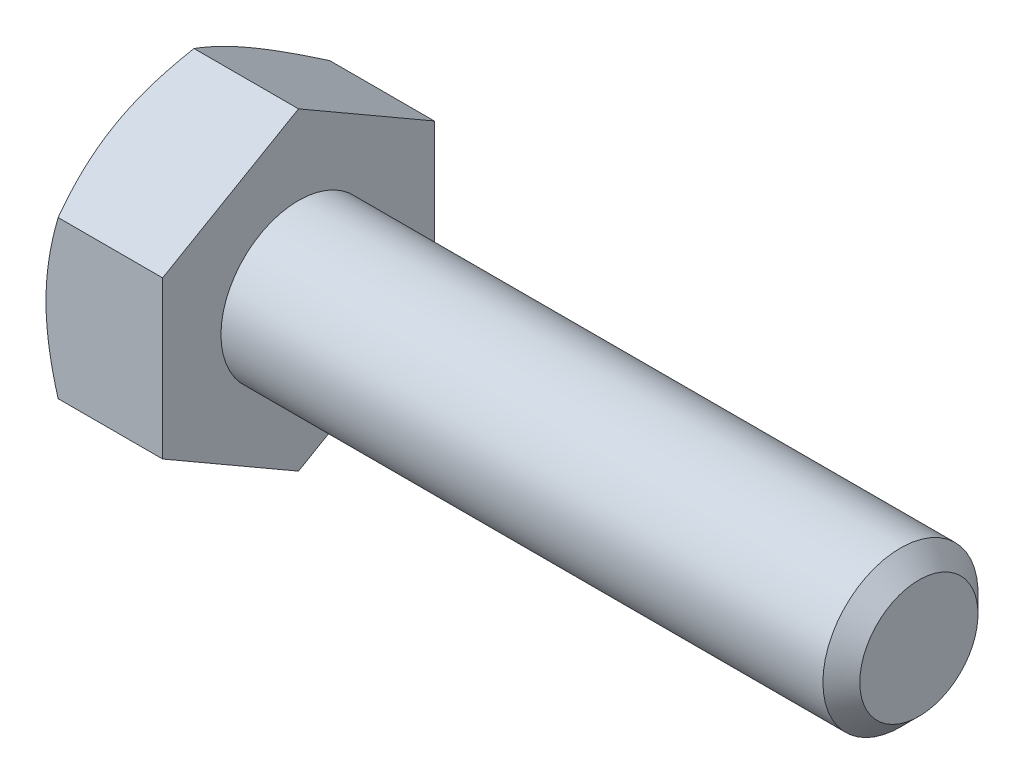
ISO-10303-21;
HEADER;
FILE_DESCRIPTION(('STEP AP214'),'2;1');
FILE_NAME('part.step','',(''),(''),'','','');
FILE_SCHEMA(('AUTOMOTIVE_DESIGN { 1 0 10303 214 1 1 1 1 }'));
ENDSEC;
DATA;
#1=APPLICATION_CONTEXT('core data for automotive mechanical design processes');
#2=APPLICATION_PROTOCOL_DEFINITION('international standard','automotive_design',2000,#1);
#3=PRODUCT_CONTEXT('',#1,'mechanical');
#4=PRODUCT('Part','Part','',(#3));
#5=PRODUCT_RELATED_PRODUCT_CATEGORY('part','',(#4));
#6=PRODUCT_DEFINITION_FORMATION('','',#4);
#7=PRODUCT_DEFINITION_CONTEXT('part definition',#1,'design');
#8=PRODUCT_DEFINITION('design','',#6,#7);
#9=PRODUCT_DEFINITION_SHAPE('','',#8);
#10=(LENGTH_UNIT() NAMED_UNIT(*) SI_UNIT(.MILLI.,.METRE.));
#11=(NAMED_UNIT(*) PLANE_ANGLE_UNIT() SI_UNIT($,.RADIAN.));
#12=(NAMED_UNIT(*) SI_UNIT($,.STERADIAN.) SOLID_ANGLE_UNIT());
#13=UNCERTAINTY_MEASURE_WITH_UNIT(LENGTH_MEASURE(1.E-05),#10,'distance_accuracy_value','');
#14=(GEOMETRIC_REPRESENTATION_CONTEXT(3) GLOBAL_UNCERTAINTY_ASSIGNED_CONTEXT((#13)) GLOBAL_UNIT_ASSIGNED_CONTEXT((#10,
#11,#12)) REPRESENTATION_CONTEXT('',''));
#15=CARTESIAN_POINT('',(0.,0.,0.));
#16=DIRECTION('',(0.,0.,1.));
#17=DIRECTION('',(1.,0.,0.));
#18=AXIS2_PLACEMENT_3D('',#15,#16,#17);
#19=CARTESIAN_POINT('',(4.7752,3.21156860739421,-5.5626));
#20=DIRECTION('',(0.,-0.866025403784438,0.500000000000001));
#21=DIRECTION('',(0.,-0.500000000000001,-0.866025403784438));
#22=AXIS2_PLACEMENT_3D('',#19,#20,#21);
#23=PLANE('',#22);
#24=CARTESIAN_POINT('',(0.496898061070139,6.42325268484227,0.0002));
#25=CARTESIAN_POINT('',(0.456146202255127,6.35265858120791,-0.122072574209491));
#26=CARTESIAN_POINT('',(0.41724377530872,6.2818012683745,-0.244801040124762));
#27=CARTESIAN_POINT('',(0.34364716156054,6.13951120287093,-0.491254662989243));
#28=CARTESIAN_POINT('',(0.308954790139042,6.06807821602766,-0.614980225538197));
#29=CARTESIAN_POINT('',(0.211873701066853,5.8526355064814,-0.98813794459262));
#30=CARTESIAN_POINT('',(0.156654841923372,5.70777535201369,-1.23904309212296));
#31=CARTESIAN_POINT('',(0.0919037861815274,5.49099476252076,-1.61451808721945));
#32=CARTESIAN_POINT('',(0.0734579983429336,5.419722058732,-1.73796603137439));
#33=CARTESIAN_POINT('',(0.0425268916674617,5.27685459691414,-1.98541973399132));
#34=CARTESIAN_POINT('',(0.0300410461890079,5.20525986790489,-2.10942544218948));
#35=CARTESIAN_POINT('',(0.0113480299394706,5.06194605565758,-2.35765224642821));
#36=CARTESIAN_POINT('',(0.00513373340584711,4.9902272065059,-2.48187293701927));
#37=CARTESIAN_POINT('',(-0.000889599359095119,4.84672720555796,-2.7304222295473));
#38=CARTESIAN_POINT('',(-0.000698833448295683,4.7749460557547,-2.85475082803225));
#39=CARTESIAN_POINT('',(0.00862810136342349,4.57828637012706,-3.19537539533984));
#40=CARTESIAN_POINT('',(0.0242873955350759,4.4534722013835,-3.41155987710816));
#41=CARTESIAN_POINT('',(0.0739443233816047,4.20467287416474,-3.84249295274001));
#42=CARTESIAN_POINT('',(0.107958931423457,4.08068859075412,-4.05724003094723));
#43=CARTESIAN_POINT('',(0.192986041409675,3.83138850679899,-4.4890404426887));
#44=CARTESIAN_POINT('',(0.244358813937399,3.70610416511176,-4.70603928788379));
#45=CARTESIAN_POINT('',(0.36095445699959,3.45740388365365,-5.13680081122592));
#46=CARTESIAN_POINT('',(0.426149937617055,3.33398475856357,-5.35056900650764));
#47=CARTESIAN_POINT('',(0.496898061070134,3.21145313734037,-5.5628));
#48=B_SPLINE_CURVE_WITH_KNOTS('',3,(#24,#25,#26,#27,#28,#29,#30,#31,#32,#33,#34,#35,#36,#37,#38,
#39,#40,#41,#42,#43,#44,#45,#46,#47),.UNSPECIFIED.,.F.,.F.,(4,2,2,2,2,2,2,2,2,2,2,4),(0.,
0.44082011856227,0.881829648847399,1.76568130465016,2.19678242164486,2.62784543796583,
3.05841812523867,3.48897751176352,4.23854798324166,4.98881282275669,5.75571809391027,
6.52111769989992),.UNSPECIFIED.);
#49=CARTESIAN_POINT('',(0.496831392605784,6.42313721478843,0.));
#50=VERTEX_POINT('',#49);
#51=CARTESIAN_POINT('',(0.,4.81735291109131,-2.78130000000001));
#52=VERTEX_POINT('',#51);
#53=EDGE_CURVE('E53',#50,#52,#48,.T.);
#54=ORIENTED_EDGE('',*,*,#53,.F.);
#55=DIRECTION('',(-1.,0.,0.));
#56=VECTOR('',#55,1.);
#57=CARTESIAN_POINT('',(4.7752,6.42313721478843,0.));
#58=LINE('',#57,#56);
#59=CARTESIAN_POINT('',(4.7752,6.42313721478843,0.));
#60=VERTEX_POINT('',#59);
#61=EDGE_CURVE('E149',#60,#50,#58,.T.);
#62=ORIENTED_EDGE('',*,*,#61,.F.);
#63=DIRECTION('',(0.,0.500000000000001,0.866025403784438));
#64=VECTOR('',#63,1.);
#65=CARTESIAN_POINT('',(4.7752,3.21156860739421,-5.5626));
#66=LINE('',#65,#64);
#67=CARTESIAN_POINT('',(4.7752,3.21156860739421,-5.5626));
#68=VERTEX_POINT('',#67);
#69=EDGE_CURVE('E234',#68,#60,#66,.T.);
#70=ORIENTED_EDGE('',*,*,#69,.F.);
#71=DIRECTION('',(-1.,0.,0.));
#72=VECTOR('',#71,1.);
#73=CARTESIAN_POINT('',(4.7752,3.21156860739421,-5.5626));
#74=LINE('',#73,#72);
#75=CARTESIAN_POINT('',(0.496831392605779,3.21156860739421,-5.5626));
#76=VERTEX_POINT('',#75);
#77=EDGE_CURVE('E137',#68,#76,#74,.T.);
#78=ORIENTED_EDGE('',*,*,#77,.T.);
#79=EDGE_CURVE('E131',#52,#76,#48,.T.);
#80=ORIENTED_EDGE('',*,*,#79,.F.);
#81=EDGE_LOOP('',(#54,#62,#70,#78,#80));
#82=FACE_BOUND('',#81,.T.);
#83=ADVANCED_FACE('F37',(#82),#23,.F.);
#84=CARTESIAN_POINT('',(4.7752,6.42313721478843,0.));
#85=DIRECTION('',(0.,-0.866025403784438,-0.500000000000001));
#86=DIRECTION('',(0.,0.500000000000001,-0.866025403784438));
#87=AXIS2_PLACEMENT_3D('',#84,#85,#86);
#88=PLANE('',#87);
#89=CARTESIAN_POINT('',(0.496898061070134,3.21145313734037,5.5628));
#90=CARTESIAN_POINT('',(0.456146202255121,3.28204724097473,5.44052742579051));
#91=CARTESIAN_POINT('',(0.417243775308715,3.35290455380814,5.31779895987524));
#92=CARTESIAN_POINT('',(0.343647161560535,3.49519461931171,5.07134533701076));
#93=CARTESIAN_POINT('',(0.308954790139038,3.56662760615499,4.9476197744618));
#94=CARTESIAN_POINT('',(0.21187370106685,3.78207031570124,4.57446205540738));
#95=CARTESIAN_POINT('',(0.15665484192337,3.92693047016895,4.32355690787704));
#96=CARTESIAN_POINT('',(0.0919037861815261,4.14371105966188,3.94808191278055));
#97=CARTESIAN_POINT('',(0.0734579983429322,4.21498376345064,3.82463396862561));
#98=CARTESIAN_POINT('',(0.0425268916674608,4.35785122526849,3.57718026600868));
#99=CARTESIAN_POINT('',(0.0300410461890074,4.42944595427775,3.45317455781052));
#100=CARTESIAN_POINT('',(0.0113480299394703,4.57275976652506,3.20494775357179));
#101=CARTESIAN_POINT('',(0.00513373340584643,4.64447861567674,3.08072706298073));
#102=CARTESIAN_POINT('',(-0.000889599359095678,4.78797861662468,2.8321777704527));
#103=CARTESIAN_POINT('',(-0.000698833448295769,4.85975976642794,2.70784917196775));
#104=CARTESIAN_POINT('',(0.00862810136342435,5.05641945205558,2.36722460466016));
#105=CARTESIAN_POINT('',(0.0242873955350771,5.18123362079914,2.15104012289184));
#106=CARTESIAN_POINT('',(0.0739443233816067,5.4300329480179,1.72010704725999));
#107=CARTESIAN_POINT('',(0.107958931423459,5.55401723142852,1.50535996905278));
#108=CARTESIAN_POINT('',(0.192986041409678,5.80331731538365,1.0735595573113));
#109=CARTESIAN_POINT('',(0.244358813937402,5.92860165707088,0.856560712116214));
#110=CARTESIAN_POINT('',(0.360954456999594,6.17730193852899,0.425799188774084));
#111=CARTESIAN_POINT('',(0.426149937617059,6.30072106361907,0.212030993492364));
#112=CARTESIAN_POINT('',(0.496898061070139,6.42325268484227,-0.000200000000000177));
#113=B_SPLINE_CURVE_WITH_KNOTS('',3,(#89,#90,#91,#92,#93,#94,#95,#96,#97,#98,#99,#100,#101,#102,
#103,#104,#105,#106,#107,#108,#109,#110,#111,#112),.UNSPECIFIED.,.F.,.F.,(4,2,2,2,2,2,2,2,2,2,2,
4),(0.,0.44082011856227,0.881829648847398,1.76568130465016,2.19678242164486,2.62784543796582,
3.05841812523867,3.48897751176352,4.23854798324165,4.98881282275669,5.75571809391027,
6.52111769989992),.UNSPECIFIED.);
#114=CARTESIAN_POINT('',(0.496831392605779,3.21156860739421,5.5626));
#115=VERTEX_POINT('',#114);
#116=CARTESIAN_POINT('',(0.,4.81735291109132,2.78130000000001));
#117=VERTEX_POINT('',#116);
#118=EDGE_CURVE('E60',#115,#117,#113,.T.);
#119=ORIENTED_EDGE('',*,*,#118,.F.);
#120=DIRECTION('',(-1.,0.,0.));
#121=VECTOR('',#120,1.);
#122=CARTESIAN_POINT('',(4.7752,3.21156860739421,5.5626));
#123=LINE('',#122,#121);
#124=CARTESIAN_POINT('',(4.7752,3.21156860739421,5.5626));
#125=VERTEX_POINT('',#124);
#126=EDGE_CURVE('E147',#125,#115,#123,.T.);
#127=ORIENTED_EDGE('',*,*,#126,.F.);
#128=DIRECTION('',(0.,-0.500000000000001,0.866025403784438));
#129=VECTOR('',#128,1.);
#130=CARTESIAN_POINT('',(4.7752,6.42313721478843,0.));
#131=LINE('',#130,#129);
#132=EDGE_CURVE('E232',#60,#125,#131,.T.);
#133=ORIENTED_EDGE('',*,*,#132,.F.);
#134=ORIENTED_EDGE('',*,*,#61,.T.);
#135=EDGE_CURVE('E164',#117,#50,#113,.T.);
#136=ORIENTED_EDGE('',*,*,#135,.F.);
#137=EDGE_LOOP('',(#119,#127,#133,#134,#136));
#138=FACE_BOUND('',#137,.T.);
#139=ADVANCED_FACE('F170',(#138),#88,.F.);
#140=CARTESIAN_POINT('',(4.7752,3.21156860739421,5.5626));
#141=DIRECTION('',(0.,0.,-1.));
#142=DIRECTION('',(0.,1.,0.));
#143=AXIS2_PLACEMENT_3D('',#140,#141,#142);
#144=PLANE('',#143);
#145=CARTESIAN_POINT('',(2.76946298300575,-8.73931907508179,5.5626));
#146=CARTESIAN_POINT('',(2.65067477861525,-8.49536496655184,5.5626));
#147=CARTESIAN_POINT('',(2.5329935446368,-8.25086273482906,5.5626));
#148=CARTESIAN_POINT('',(2.30046552472365,-7.7604709003827,5.5626));
#149=CARTESIAN_POINT('',(2.1856191646097,-7.51458109596806,5.5626));
#150=CARTESIAN_POINT('',(1.95882765731768,-7.0199096787591,5.5626));
#151=CARTESIAN_POINT('',(1.84690075513497,-6.77111967311545,5.5626));
#152=CARTESIAN_POINT('',(1.62748022476039,-6.27159952967085,5.5626));
#153=CARTESIAN_POINT('',(1.51998639425645,-6.02086948102922,5.5626));
#154=CARTESIAN_POINT('',(1.30708686388972,-5.50862062722721,5.5626));
#155=CARTESIAN_POINT('',(1.20187213532633,-5.24702202923403,5.5626));
#156=CARTESIAN_POINT('',(0.999136459179903,-4.72080610855176,5.5626));
#157=CARTESIAN_POINT('',(0.901616358819175,-4.45618845710901,5.5626));
#158=CARTESIAN_POINT('',(0.716747077259975,-3.92397402708935,5.5626));
#159=CARTESIAN_POINT('',(0.629378259967488,-3.65638413524642,5.5626));
#160=CARTESIAN_POINT('',(0.467540995587156,-3.11736467473257,5.5626));
#161=CARTESIAN_POINT('',(0.393068604009399,-2.84593630766607,5.5626));
#162=CARTESIAN_POINT('',(0.260913640631054,-2.30059524064208,5.5626));
#163=CARTESIAN_POINT('',(0.203137923936709,-2.02670547200284,5.5626));
#164=CARTESIAN_POINT('',(0.107584140927258,-1.47536640564423,5.5626));
#165=CARTESIAN_POINT('',(0.069803929738993,-1.19791749297778,5.5626));
#166=CARTESIAN_POINT('',(0.0306329032322196,-0.782024036094212,5.5626));
#167=CARTESIAN_POINT('',(0.020503324362524,-0.644369602420744,5.5626));
#168=CARTESIAN_POINT('',(0.00607539244269749,-0.368760083391722,5.5626));
#169=CARTESIAN_POINT('',(0.00177648777087112,-0.230805027714104,5.5626));
#170=CARTESIAN_POINT('',(-0.000882415982739104,0.0451740127451355,5.5626));
#171=CARTESIAN_POINT('',(0.000758104232646407,0.183198002498893,5.5626));
#172=CARTESIAN_POINT('',(0.00993570132662422,0.459040079963629,5.5626));
#173=CARTESIAN_POINT('',(0.0174725518603889,0.596858175374894,5.5626));
#174=CARTESIAN_POINT('',(0.0422505229084574,0.924672768817545,5.5626));
#175=CARTESIAN_POINT('',(0.0620998983879059,1.11447655248114,5.5626));
#176=CARTESIAN_POINT('',(0.111925243816852,1.49274006022235,5.5626));
#177=CARTESIAN_POINT('',(0.141902493413722,1.68119961138343,5.5626));
#178=CARTESIAN_POINT('',(0.245441795133941,2.2443046927153,5.5626));
#179=CARTESIAN_POINT('',(0.332595182135708,2.61648784181077,5.5626));
#180=CARTESIAN_POINT('',(0.484580657527378,3.1732742336233,5.5626));
#181=CARTESIAN_POINT('',(0.539535148349873,3.36074034143572,5.5626));
#182=CARTESIAN_POINT('',(0.655361857948689,3.73385345534555,5.5626));
#183=CARTESIAN_POINT('',(0.71623412173346,3.9195004475956,5.5626));
#184=CARTESIAN_POINT('',(0.842902269493749,4.28903174270247,5.5626));
#185=CARTESIAN_POINT('',(0.908696734383913,4.47291653649103,5.5626));
#186=CARTESIAN_POINT('',(1.04441413366769,4.83914665056045,5.5626));
#187=CARTESIAN_POINT('',(1.11433697738279,5.02149200455412,5.5626));
#188=CARTESIAN_POINT('',(1.3061625425825,5.50788800286086,5.5626));
#189=CARTESIAN_POINT('',(1.43118964362203,5.81070522079336,5.5626));
#190=CARTESIAN_POINT('',(1.68847909941209,6.41326146735261,5.5626));
#191=CARTESIAN_POINT('',(1.82074222486502,6.71300016403485,5.5626));
#192=CARTESIAN_POINT('',(2.09080854484645,7.31009693194887,5.5626));
#193=CARTESIAN_POINT('',(2.2286137757305,7.60745407909744,5.5626));
#194=CARTESIAN_POINT('',(2.50845292691855,8.20015103360304,5.5626));
#195=CARTESIAN_POINT('',(2.65048668230203,8.49549091908621,5.5626));
#196=CARTESIAN_POINT('',(2.93809441213761,9.08501121353834,5.5626));
#197=CARTESIAN_POINT('',(3.08367358186692,9.37918908275016,5.5626));
#198=CARTESIAN_POINT('',(3.37748078904248,9.96621951864088,5.5626));
#199=CARTESIAN_POINT('',(3.52570884757213,10.2590720747479,5.5626));
#200=CARTESIAN_POINT('',(3.97349977904315,11.1358830052649,5.5626));
#201=CARTESIAN_POINT('',(4.2762321417869,11.7182219945537,5.5626));
#202=CARTESIAN_POINT('',(4.85550678228878,12.8193647810355,5.5626));
#203=CARTESIAN_POINT('',(5.13148986853599,13.3384641758493,5.5626));
#204=CARTESIAN_POINT('',(5.68680572895229,14.3749069872876,5.5626));
#205=CARTESIAN_POINT('',(5.96613870161303,14.8922502975048,5.5626));
#206=CARTESIAN_POINT('',(6.52636532741204,15.9238879385591,5.5626));
#207=CARTESIAN_POINT('',(6.80725083144903,16.4381867017066,5.5626));
#208=CARTESIAN_POINT('',(7.37092859266389,17.4656872191565,5.5626));
#209=CARTESIAN_POINT('',(7.65372070150562,17.9788890548016,5.5626));
#210=CARTESIAN_POINT('',(7.93720779623418,18.4917042787924,5.5626));
#211=B_SPLINE_CURVE_WITH_KNOTS('',3,(#145,#146,#147,#148,#149,#150,#151,#152,#153,#154,#155,
#156,#157,#158,#159,#160,#161,#162,#163,#164,#165,#166,#167,#168,#169,#170,#171,#172,#173,#174,
#175,#176,#177,#178,#179,#180,#181,#182,#183,#184,#185,#186,#187,#188,#189,#190,#191,#192,#193,
#194,#195,#196,#197,#198,#199,#200,#201,#202,#203,#204,#205,#206,#207,#208,#209,#210),
.UNSPECIFIED.,.F.,.F.,(4,2,2,2,2,2,2,2,2,2,2,2,2,2,2,2,2,2,2,2,2,2,2,2,2,2,2,2,2,2,2,2,4),(0.,
0.814023059896038,1.62816765754195,2.44655638702215,3.26490772627512,4.11070764230637,
4.95660055613667,5.80082897545883,6.64479872196118,7.48396511886281,8.32304148200847,
8.73701668482868,9.15095272002816,9.5649249474527,9.97888128433685,10.5510771721585,
11.1233453834466,12.2684477479276,12.854460366026,13.4404774414739,14.0263262127402,
14.6121621208114,15.5948602808078,16.5776633116356,17.5608308169621,18.5439600269871,
19.5286286939574,20.5133052017346,22.4822323672198,24.245931208995,26.0097350771296,
27.7677407362569,29.5256111634693),.UNSPECIFIED.);
#212=CARTESIAN_POINT('',(0.496831392605775,-3.21156860739419,5.5626));
#213=VERTEX_POINT('',#212);
#214=CARTESIAN_POINT('',(0.,0.,5.5626));
#215=VERTEX_POINT('',#214);
#216=EDGE_CURVE('E244',#213,#215,#211,.T.);
#217=ORIENTED_EDGE('',*,*,#216,.F.);
#218=DIRECTION('',(-1.,0.,0.));
#219=VECTOR('',#218,1.);
#220=CARTESIAN_POINT('',(4.7752,-3.21156860739419,5.5626));
#221=LINE('',#220,#219);
#222=CARTESIAN_POINT('',(4.7752,-3.21156860739419,5.5626));
#223=VERTEX_POINT('',#222);
#224=EDGE_CURVE('E139',#223,#213,#221,.T.);
#225=ORIENTED_EDGE('',*,*,#224,.F.);
#226=DIRECTION('',(0.,-1.,0.));
#227=VECTOR('',#226,1.);
#228=CARTESIAN_POINT('',(4.7752,3.21156860739421,5.5626));
#229=LINE('',#228,#227);
#230=EDGE_CURVE('E228',#125,#223,#229,.T.);
#231=ORIENTED_EDGE('',*,*,#230,.F.);
#232=ORIENTED_EDGE('',*,*,#126,.T.);
#233=EDGE_CURVE('E186',#215,#115,#211,.T.);
#234=ORIENTED_EDGE('',*,*,#233,.F.);
#235=EDGE_LOOP('',(#217,#225,#231,#232,#234));
#236=FACE_BOUND('',#235,.T.);
#237=ADVANCED_FACE('F250',(#236),#144,.F.);
#238=CARTESIAN_POINT('',(4.7752,-6.42313721478842,0.));
#239=DIRECTION('',(0.,0.866025403784438,-0.500000000000002));
#240=DIRECTION('',(0.,0.500000000000002,0.866025403784438));
#241=AXIS2_PLACEMENT_3D('',#238,#239,#240);
#242=PLANE('',#241);
#243=CARTESIAN_POINT('',(0.496898061070134,-6.42325268484226,-0.000200000000000053));
#244=CARTESIAN_POINT('',(0.456146202255122,-6.3526585812079,0.12207257420949));
#245=CARTESIAN_POINT('',(0.417243775308715,-6.28180126837449,0.244801040124762));
#246=CARTESIAN_POINT('',(0.343647161560535,-6.13951120287092,0.491254662989242));
#247=CARTESIAN_POINT('',(0.308954790139037,-6.06807821602765,0.614980225538196));
#248=CARTESIAN_POINT('',(0.211873701066847,-5.85263550648139,0.988137944592617));
#249=CARTESIAN_POINT('',(0.156654841923367,-5.70777535201368,1.23904309212296));
#250=CARTESIAN_POINT('',(0.0919037861815225,-5.49099476252075,1.61451808721945));
#251=CARTESIAN_POINT('',(0.0734579983429283,-5.41972205873199,1.73796603137439));
#252=CARTESIAN_POINT('',(0.0425268916674564,-5.27685459691413,1.98541973399132));
#253=CARTESIAN_POINT('',(0.0300410461890029,-5.20525986790488,2.10942544218947));
#254=CARTESIAN_POINT('',(0.0113480299394653,-5.06194605565756,2.3576522464282));
#255=CARTESIAN_POINT('',(0.00513373340584106,-4.99022720650589,2.48187293701927));
#256=CARTESIAN_POINT('',(-0.000889599359101576,-4.84672720555795,2.73042222954729));
#257=CARTESIAN_POINT('',(-0.000698833448301867,-4.77494605575469,2.85475082803224));
#258=CARTESIAN_POINT('',(0.00862810136341747,-4.57828637012705,3.19537539533984));
#259=CARTESIAN_POINT('',(0.0242873955350695,-4.45347220138349,3.41155987710815));
#260=CARTESIAN_POINT('',(0.073944323381598,-4.20467287416473,3.84249295274001));
#261=CARTESIAN_POINT('',(0.107958931423451,-4.08068859075411,4.05724003094722));
#262=CARTESIAN_POINT('',(0.192986041409669,-3.83138850679897,4.48904044268869));
#263=CARTESIAN_POINT('',(0.244358813937393,-3.70610416511175,4.70603928788378));
#264=CARTESIAN_POINT('',(0.360954456999585,-3.45740388365364,5.13680081122591));
#265=CARTESIAN_POINT('',(0.42614993761705,-3.33398475856355,5.35056900650763));
#266=CARTESIAN_POINT('',(0.496898061070129,-3.21145313734035,5.5628));
#267=B_SPLINE_CURVE_WITH_KNOTS('',3,(#243,#244,#245,#246,#247,#248,#249,#250,#251,#252,#253,
#254,#255,#256,#257,#258,#259,#260,#261,#262,#263,#264,#265,#266),.UNSPECIFIED.,.F.,.F.,(4,2,2,
2,2,2,2,2,2,2,2,4),(0.,0.440820118562269,0.881829648847397,1.76568130465016,2.19678242164486,
2.62784543796582,3.05841812523867,3.48897751176352,4.23854798324165,4.98881282275669,
5.75571809391027,6.52111769989993),.UNSPECIFIED.);
#268=CARTESIAN_POINT('',(0.496831392605779,-6.42313721478842,0.));
#269=VERTEX_POINT('',#268);
#270=CARTESIAN_POINT('',(0.,-4.81735291109131,2.78130000000001));
#271=VERTEX_POINT('',#270);
#272=EDGE_CURVE('E172',#269,#271,#267,.T.);
#273=ORIENTED_EDGE('',*,*,#272,.F.);
#274=DIRECTION('',(-1.,0.,0.));
#275=VECTOR('',#274,1.);
#276=CARTESIAN_POINT('',(4.7752,-6.42313721478842,0.));
#277=LINE('',#276,#275);
#278=CARTESIAN_POINT('',(4.7752,-6.42313721478842,0.));
#279=VERTEX_POINT('',#278);
#280=EDGE_CURVE('E136',#279,#269,#277,.T.);
#281=ORIENTED_EDGE('',*,*,#280,.F.);
#282=DIRECTION('',(0.,-0.500000000000002,-0.866025403784438));
#283=VECTOR('',#282,1.);
#284=CARTESIAN_POINT('',(4.7752,-6.42313721478842,0.));
#285=LINE('',#284,#283);
#286=EDGE_CURVE('E226',#223,#279,#285,.T.);
#287=ORIENTED_EDGE('',*,*,#286,.F.);
#288=ORIENTED_EDGE('',*,*,#224,.T.);
#289=EDGE_CURVE('E174',#271,#213,#267,.T.);
#290=ORIENTED_EDGE('',*,*,#289,.F.);
#291=EDGE_LOOP('',(#273,#281,#287,#288,#290));
#292=FACE_BOUND('',#291,.T.);
#293=ADVANCED_FACE('F222',(#292),#242,.F.);
#294=CARTESIAN_POINT('',(4.7752,-3.21156860739422,-5.5626));
#295=DIRECTION('',(0.,0.866025403784439,0.499999999999999));
#296=DIRECTION('',(0.,-0.499999999999999,0.866025403784439));
#297=AXIS2_PLACEMENT_3D('',#294,#295,#296);
#298=PLANE('',#297);
#299=CARTESIAN_POINT('',(0.496898061070136,-3.21145313734038,-5.5628));
#300=CARTESIAN_POINT('',(0.456146202255125,-3.28204724097474,-5.44052742579051));
#301=CARTESIAN_POINT('',(0.417243775308717,-3.35290455380815,-5.31779895987524));
#302=CARTESIAN_POINT('',(0.343647161560538,-3.49519461931171,-5.07134533701076));
#303=CARTESIAN_POINT('',(0.308954790139039,-3.56662760615499,-4.9476197744618));
#304=CARTESIAN_POINT('',(0.211873701066851,-3.78207031570125,-4.57446205540738));
#305=CARTESIAN_POINT('',(0.156654841923371,-3.92693047016895,-4.32355690787704));
#306=CARTESIAN_POINT('',(0.0919037861815264,-4.14371105966189,-3.94808191278055));
#307=CARTESIAN_POINT('',(0.0734579983429325,-4.21498376345065,-3.8246339686256));
#308=CARTESIAN_POINT('',(0.0425268916674607,-4.3578512252685,-3.57718026600868));
#309=CARTESIAN_POINT('',(0.0300410461890071,-4.42944595427775,-3.45317455781052));
#310=CARTESIAN_POINT('',(0.0113480299394701,-4.57275976652507,-3.20494775357179));
#311=CARTESIAN_POINT('',(0.00513373340584674,-4.64447861567674,-3.08072706298073));
#312=CARTESIAN_POINT('',(-0.000889599359095496,-4.78797861662468,-2.8321777704527));
#313=CARTESIAN_POINT('',(-0.000698833448296184,-4.85975976642794,-2.70784917196775));
#314=CARTESIAN_POINT('',(0.00862810136342299,-5.05641945205558,-2.36722460466016));
#315=CARTESIAN_POINT('',(0.0242873955350758,-5.18123362079913,-2.15104012289184));
#316=CARTESIAN_POINT('',(0.0739443233816048,-5.4300329480179,-1.72010704725999));
#317=CARTESIAN_POINT('',(0.107958931423457,-5.55401723142852,-1.50535996905277));
#318=CARTESIAN_POINT('',(0.192986041409675,-5.80331731538365,-1.0735595573113));
#319=CARTESIAN_POINT('',(0.244358813937399,-5.92860165707087,-0.856560712116213));
#320=CARTESIAN_POINT('',(0.36095445699959,-6.17730193852898,-0.425799188774084));
#321=CARTESIAN_POINT('',(0.426149937617055,-6.30072106361906,-0.212030993492364));
#322=CARTESIAN_POINT('',(0.496898061070133,-6.42325268484226,0.000200000000000243));
#323=B_SPLINE_CURVE_WITH_KNOTS('',3,(#299,#300,#301,#302,#303,#304,#305,#306,#307,#308,#309,
#310,#311,#312,#313,#314,#315,#316,#317,#318,#319,#320,#321,#322),.UNSPECIFIED.,.F.,.F.,(4,2,2,
2,2,2,2,2,2,2,2,4),(0.,0.44082011856227,0.881829648847399,1.76568130465016,2.19678242164486,
2.62784543796582,3.05841812523867,3.48897751176352,4.23854798324165,4.98881282275669,
5.75571809391027,6.52111769989991),.UNSPECIFIED.);
#324=CARTESIAN_POINT('',(0.496831392605573,-3.21156860739453,-5.5626));
#325=VERTEX_POINT('',#324);
#326=CARTESIAN_POINT('',(0.,-4.81735291109132,-2.7813));
#327=VERTEX_POINT('',#326);
#328=EDGE_CURVE('E113',#325,#327,#323,.T.);
#329=ORIENTED_EDGE('',*,*,#328,.F.);
#330=DIRECTION('',(-1.,0.,0.));
#331=VECTOR('',#330,1.);
#332=CARTESIAN_POINT('',(4.7752,-3.21156860739422,-5.5626));
#333=LINE('',#332,#331);
#334=CARTESIAN_POINT('',(4.7752,-3.21156860739422,-5.5626));
#335=VERTEX_POINT('',#334);
#336=EDGE_CURVE('E127',#335,#325,#333,.T.);
#337=ORIENTED_EDGE('',*,*,#336,.F.);
#338=DIRECTION('',(0.,0.499999999999999,-0.866025403784439));
#339=VECTOR('',#338,1.);
#340=CARTESIAN_POINT('',(4.7752,-3.21156860739422,-5.5626));
#341=LINE('',#340,#339);
#342=EDGE_CURVE('E224',#279,#335,#341,.T.);
#343=ORIENTED_EDGE('',*,*,#342,.F.);
#344=ORIENTED_EDGE('',*,*,#280,.T.);
#345=EDGE_CURVE('E130',#327,#269,#323,.T.);
#346=ORIENTED_EDGE('',*,*,#345,.F.);
#347=EDGE_LOOP('',(#329,#337,#343,#344,#346));
#348=FACE_BOUND('',#347,.T.);
#349=ADVANCED_FACE('F125',(#348),#298,.F.);
#350=CARTESIAN_POINT('',(4.7752,3.21156860739421,-5.5626));
#351=DIRECTION('',(0.,0.,1.));
#352=DIRECTION('',(0.,-1.,0.));
#353=AXIS2_PLACEMENT_3D('',#350,#351,#352);
#354=PLANE('',#353);
#355=CARTESIAN_POINT('',(2.76946298300577,-8.73931907508182,-5.5626));
#356=CARTESIAN_POINT('',(2.65067477861526,-8.49536496655187,-5.5626));
#357=CARTESIAN_POINT('',(2.53299354463681,-8.25086273482909,-5.5626));
#358=CARTESIAN_POINT('',(2.30046552472366,-7.76047090038272,-5.5626));
#359=CARTESIAN_POINT('',(2.18561916460971,-7.51458109596809,-5.5626));
#360=CARTESIAN_POINT('',(1.95882765731769,-7.01990967875913,-5.5626));
#361=CARTESIAN_POINT('',(1.84690075513498,-6.77111967311548,-5.5626));
#362=CARTESIAN_POINT('',(1.6274802247604,-6.27159952967088,-5.5626));
#363=CARTESIAN_POINT('',(1.51998639425646,-6.02086948102925,-5.5626));
#364=CARTESIAN_POINT('',(1.30708686388974,-5.50862062722724,-5.5626));
#365=CARTESIAN_POINT('',(1.20187213532634,-5.24702202923405,-5.5626));
#366=CARTESIAN_POINT('',(0.999136459179912,-4.72080610855178,-5.5626));
#367=CARTESIAN_POINT('',(0.901616358819183,-4.45618845710904,-5.5626));
#368=CARTESIAN_POINT('',(0.716747077259982,-3.92397402708937,-5.5626));
#369=CARTESIAN_POINT('',(0.629378259967495,-3.65638413524644,-5.5626));
#370=CARTESIAN_POINT('',(0.467540995587163,-3.11736467473259,-5.5626));
#371=CARTESIAN_POINT('',(0.393068604009405,-2.84593630766609,-5.5626));
#372=CARTESIAN_POINT('',(0.260913640631059,-2.3005952406421,-5.5626));
#373=CARTESIAN_POINT('',(0.203137923936713,-2.02670547200285,-5.5626));
#374=CARTESIAN_POINT('',(0.10758414092726,-1.47536640564425,-5.5626));
#375=CARTESIAN_POINT('',(0.0698039297389953,-1.19791749297779,-5.5626));
#376=CARTESIAN_POINT('',(0.0306329032322215,-0.782024036094229,-5.5626));
#377=CARTESIAN_POINT('',(0.0205033243625257,-0.64436960242076,-5.5626));
#378=CARTESIAN_POINT('',(0.00607539244269874,-0.368760083391739,-5.5626));
#379=CARTESIAN_POINT('',(0.00177648777087199,-0.23080502771412,-5.5626));
#380=CARTESIAN_POINT('',(-0.000882415982738976,0.0451740127451187,-5.5626));
#381=CARTESIAN_POINT('',(0.000758104232646165,0.183198002498876,-5.5626));
#382=CARTESIAN_POINT('',(0.00993570132662349,0.459040079963613,-5.5626));
#383=CARTESIAN_POINT('',(0.0174725518603881,0.596858175374878,-5.5626));
#384=CARTESIAN_POINT('',(0.0422505229084561,0.92467276881753,-5.5626));
#385=CARTESIAN_POINT('',(0.0620998983879042,1.11447655248113,-5.5626));
#386=CARTESIAN_POINT('',(0.111925243816849,1.49274006022233,-5.5626));
#387=CARTESIAN_POINT('',(0.141902493413719,1.68119961138341,-5.5626));
#388=CARTESIAN_POINT('',(0.245441795133937,2.24430469271528,-5.5626));
#389=CARTESIAN_POINT('',(0.332595182135703,2.61648784181075,-5.5626));
#390=CARTESIAN_POINT('',(0.484580657527372,3.17327423362328,-5.5626));
#391=CARTESIAN_POINT('',(0.539535148349867,3.3607403414357,-5.5626));
#392=CARTESIAN_POINT('',(0.655361857948683,3.73385345534553,-5.5626));
#393=CARTESIAN_POINT('',(0.716234121733452,3.91950044759557,-5.5626));
#394=CARTESIAN_POINT('',(0.84290226949374,4.28903174270244,-5.5626));
#395=CARTESIAN_POINT('',(0.908696734383904,4.472916536491,-5.5626));
#396=CARTESIAN_POINT('',(1.04441413366768,4.83914665056042,-5.5626));
#397=CARTESIAN_POINT('',(1.11433697738278,5.0214920045541,-5.5626));
#398=CARTESIAN_POINT('',(1.30616254258249,5.50788800286084,-5.5626));
#399=CARTESIAN_POINT('',(1.43118964362202,5.81070522079333,-5.5626));
#400=CARTESIAN_POINT('',(1.68847909941208,6.41326146735258,-5.5626));
#401=CARTESIAN_POINT('',(1.82074222486501,6.71300016403482,-5.5626));
#402=CARTESIAN_POINT('',(2.09080854484644,7.31009693194885,-5.5626));
#403=CARTESIAN_POINT('',(2.22861377573049,7.60745407909742,-5.5626));
#404=CARTESIAN_POINT('',(2.50845292691854,8.20015103360302,-5.5626));
#405=CARTESIAN_POINT('',(2.65048668230202,8.49549091908619,-5.5626));
#406=CARTESIAN_POINT('',(2.9380944121376,9.08501121353832,-5.5626));
#407=CARTESIAN_POINT('',(3.08367358186691,9.37918908275015,-5.5626));
#408=CARTESIAN_POINT('',(3.37748078904247,9.96621951864087,-5.5626));
#409=CARTESIAN_POINT('',(3.52570884757212,10.2590720747479,-5.5626));
#410=CARTESIAN_POINT('',(3.97349977904315,11.1358830052649,-5.5626));
#411=CARTESIAN_POINT('',(4.2762321417869,11.7182219945537,-5.5626));
#412=CARTESIAN_POINT('',(4.85550678228878,12.8193647810355,-5.5626));
#413=CARTESIAN_POINT('',(5.13148986853599,13.3384641758492,-5.5626));
#414=CARTESIAN_POINT('',(5.68680572895229,14.3749069872876,-5.5626));
#415=CARTESIAN_POINT('',(5.96613870161303,14.8922502975048,-5.5626));
#416=CARTESIAN_POINT('',(6.52636532741205,15.9238879385591,-5.5626));
#417=CARTESIAN_POINT('',(6.80725083144903,16.4381867017066,-5.5626));
#418=CARTESIAN_POINT('',(7.37092859266389,17.4656872191565,-5.5626));
#419=CARTESIAN_POINT('',(7.65372070150562,17.9788890548016,-5.5626));
#420=CARTESIAN_POINT('',(7.93720779623418,18.4917042787925,-5.5626));
#421=B_SPLINE_CURVE_WITH_KNOTS('',3,(#355,#356,#357,#358,#359,#360,#361,#362,#363,#364,#365,
#366,#367,#368,#369,#370,#371,#372,#373,#374,#375,#376,#377,#378,#379,#380,#381,#382,#383,#384,
#385,#386,#387,#388,#389,#390,#391,#392,#393,#394,#395,#396,#397,#398,#399,#400,#401,#402,#403,
#404,#405,#406,#407,#408,#409,#410,#411,#412,#413,#414,#415,#416,#417,#418,#419,#420),
.UNSPECIFIED.,.F.,.F.,(4,2,2,2,2,2,2,2,2,2,2,2,2,2,2,2,2,2,2,2,2,2,2,2,2,2,2,2,2,2,2,2,4),(0.,
0.814023059896038,1.62816765754195,2.44655638702215,3.26490772627512,4.11070764230637,
4.95660055613667,5.80082897545883,6.64479872196119,7.48396511886282,8.32304148200848,
8.73701668482869,9.15095272002817,9.56492494745271,9.97888128433686,10.5510771721585,
11.1233453834466,12.2684477479276,12.854460366026,13.4404774414739,14.0263262127402,
14.6121621208114,15.5948602808078,16.5776633116356,17.5608308169621,18.5439600269871,
19.5286286939574,20.5133052017346,22.4822323672198,24.245931208995,26.0097350771297,
27.7677407362569,29.5256111634693),.UNSPECIFIED.);
#422=CARTESIAN_POINT('',(0.,0.,-5.5626));
#423=VERTEX_POINT('',#422);
#424=EDGE_CURVE('E119',#76,#423,#421,.F.);
#425=ORIENTED_EDGE('',*,*,#424,.F.);
#426=ORIENTED_EDGE('',*,*,#77,.F.);
#427=DIRECTION('',(0.,1.,0.));
#428=VECTOR('',#427,1.);
#429=CARTESIAN_POINT('',(4.7752,3.21156860739421,-5.5626));
#430=LINE('',#429,#428);
#431=EDGE_CURVE('E135',#335,#68,#430,.T.);
#432=ORIENTED_EDGE('',*,*,#431,.F.);
#433=ORIENTED_EDGE('',*,*,#336,.T.);
#434=EDGE_CURVE('E110',#423,#325,#421,.F.);
#435=ORIENTED_EDGE('',*,*,#434,.F.);
#436=EDGE_LOOP('',(#425,#426,#432,#433,#435));
#437=FACE_BOUND('',#436,.T.);
#438=ADVANCED_FACE('F133',(#437),#354,.F.);
#439=CARTESIAN_POINT('',(4.7752,6.42313721478843,0.));
#440=DIRECTION('',(1.,0.,0.));
#441=DIRECTION('',(0.,0.,-1.));
#442=AXIS2_PLACEMENT_3D('',#439,#440,#441);
#443=PLANE('',#442);
#444=CARTESIAN_POINT('',(4.7752,0.,0.));
#445=DIRECTION('',(1.,0.,0.));
#446=DIRECTION('',(0.,0.,-1.));
#447=AXIS2_PLACEMENT_3D('',#444,#445,#446);
#448=CIRCLE('',#447,3.175);
#449=CARTESIAN_POINT('',(4.7752,0.,-3.175));
#450=VERTEX_POINT('',#449);
#451=EDGE_CURVE('E237',#450,#450,#448,.F.);
#452=ORIENTED_EDGE('',*,*,#451,.T.);
#453=EDGE_LOOP('',(#452));
#454=FACE_BOUND('',#453,.T.);
#455=ORIENTED_EDGE('',*,*,#69,.T.);
#456=ORIENTED_EDGE('',*,*,#132,.T.);
#457=ORIENTED_EDGE('',*,*,#230,.T.);
#458=ORIENTED_EDGE('',*,*,#286,.T.);
#459=ORIENTED_EDGE('',*,*,#342,.T.);
#460=ORIENTED_EDGE('',*,*,#431,.T.);
#461=EDGE_LOOP('',(#455,#456,#457,#458,#459,#460));
#462=FACE_BOUND('',#461,.T.);
#463=ADVANCED_FACE('F252',(#454,#462),#443,.T.);
#464=CARTESIAN_POINT('',(0.,0.,0.));
#465=DIRECTION('',(-1.,0.,0.));
#466=DIRECTION('',(0.,0.,1.));
#467=AXIS2_PLACEMENT_3D('',#464,#465,#466);
#468=CYLINDRICAL_SURFACE('',#467,3.175);
#469=ORIENTED_EDGE('',*,*,#451,.F.);
#470=EDGE_LOOP('',(#469));
#471=FACE_BOUND('',#470,.T.);
#472=CARTESIAN_POINT('',(29.41955,0.,0.));
#473=DIRECTION('',(-1.,0.,0.));
#474=DIRECTION('',(0.,0.,1.));
#475=AXIS2_PLACEMENT_3D('',#472,#473,#474);
#476=CIRCLE('',#475,3.175);
#477=CARTESIAN_POINT('',(29.41955,0.,3.175));
#478=VERTEX_POINT('',#477);
#479=EDGE_CURVE('E240',#478,#478,#476,.T.);
#480=ORIENTED_EDGE('',*,*,#479,.T.);
#481=EDGE_LOOP('',(#480));
#482=FACE_BOUND('',#481,.T.);
#483=ADVANCED_FACE('F283',(#471,#482),#468,.T.);
#484=CARTESIAN_POINT('',(30.1752,0.,0.));
#485=DIRECTION('',(-1.,0.,0.));
#486=DIRECTION('',(0.,0.,1.));
#487=AXIS2_PLACEMENT_3D('',#484,#485,#486);
#488=CONICAL_SURFACE('',#487,2.41935,0.785398163397437);
#489=ORIENTED_EDGE('',*,*,#479,.F.);
#490=EDGE_LOOP('',(#489));
#491=FACE_BOUND('',#490,.T.);
#492=CARTESIAN_POINT('',(30.1752,0.,0.));
#493=DIRECTION('',(-1.,0.,0.));
#494=DIRECTION('',(0.,0.,1.));
#495=AXIS2_PLACEMENT_3D('',#492,#493,#494);
#496=CIRCLE('',#495,2.41935);
#497=CARTESIAN_POINT('',(30.1752,0.,2.41935));
#498=VERTEX_POINT('',#497);
#499=EDGE_CURVE('E242',#498,#498,#496,.T.);
#500=ORIENTED_EDGE('',*,*,#499,.T.);
#501=EDGE_LOOP('',(#500));
#502=FACE_BOUND('',#501,.T.);
#503=ADVANCED_FACE('F286',(#491,#502),#488,.T.);
#504=CARTESIAN_POINT('',(30.1752,0.,0.));
#505=DIRECTION('',(-1.,0.,0.));
#506=DIRECTION('',(0.,0.,1.));
#507=AXIS2_PLACEMENT_3D('',#504,#505,#506);
#508=PLANE('',#507);
#509=ORIENTED_EDGE('',*,*,#499,.F.);
#510=EDGE_LOOP('',(#509));
#511=FACE_BOUND('',#510,.T.);
#512=ADVANCED_FACE('F199',(#511),#508,.F.);
#513=CARTESIAN_POINT('',(0.,0.,0.));
#514=DIRECTION('',(1.,0.,0.));
#515=DIRECTION('',(0.,0.,-1.));
#516=AXIS2_PLACEMENT_3D('',#513,#514,#515);
#517=CONICAL_SURFACE('',#516,5.5626,1.0471975511966);
#518=ORIENTED_EDGE('',*,*,#328,.T.);
#519=CARTESIAN_POINT('',(0.,0.,0.));
#520=DIRECTION('',(1.,0.,0.));
#521=DIRECTION('',(0.,0.,-1.));
#522=AXIS2_PLACEMENT_3D('',#519,#520,#521);
#523=CIRCLE('',#522,5.5626);
#524=EDGE_CURVE('E41',#327,#423,#523,.T.);
#525=ORIENTED_EDGE('',*,*,#524,.T.);
#526=ORIENTED_EDGE('',*,*,#434,.T.);
#527=EDGE_LOOP('',(#518,#525,#526));
#528=FACE_BOUND('',#527,.T.);
#529=ADVANCED_FACE('F112',(#528),#517,.T.);
#530=ORIENTED_EDGE('',*,*,#272,.T.);
#531=EDGE_CURVE('E154',#271,#327,#523,.T.);
#532=ORIENTED_EDGE('',*,*,#531,.T.);
#533=ORIENTED_EDGE('',*,*,#345,.T.);
#534=EDGE_LOOP('',(#530,#532,#533));
#535=FACE_BOUND('',#534,.T.);
#536=ADVANCED_FACE('F198',(#535),#517,.T.);
#537=ORIENTED_EDGE('',*,*,#216,.T.);
#538=EDGE_CURVE('E155',#215,#271,#523,.T.);
#539=ORIENTED_EDGE('',*,*,#538,.T.);
#540=ORIENTED_EDGE('',*,*,#289,.T.);
#541=EDGE_LOOP('',(#537,#539,#540));
#542=FACE_BOUND('',#541,.T.);
#543=ADVANCED_FACE('F193',(#542),#517,.T.);
#544=ORIENTED_EDGE('',*,*,#233,.T.);
#545=ORIENTED_EDGE('',*,*,#118,.T.);
#546=CARTESIAN_POINT('',(0.,0.,0.));
#547=DIRECTION('',(-1.,0.,0.));
#548=DIRECTION('',(0.,0.,1.));
#549=AXIS2_PLACEMENT_3D('',#546,#547,#548);
#550=CIRCLE('',#549,5.5626);
#551=EDGE_CURVE('E120',#215,#117,#550,.T.);
#552=ORIENTED_EDGE('',*,*,#551,.F.);
#553=EDGE_LOOP('',(#544,#545,#552));
#554=FACE_BOUND('',#553,.T.);
#555=ADVANCED_FACE('F197',(#554),#517,.T.);
#556=ORIENTED_EDGE('',*,*,#135,.T.);
#557=ORIENTED_EDGE('',*,*,#53,.T.);
#558=EDGE_CURVE('E46',#52,#117,#523,.T.);
#559=ORIENTED_EDGE('',*,*,#558,.T.);
#560=EDGE_LOOP('',(#556,#557,#559));
#561=FACE_BOUND('',#560,.T.);
#562=ADVANCED_FACE('F163',(#561),#517,.T.);
#563=ORIENTED_EDGE('',*,*,#79,.T.);
#564=ORIENTED_EDGE('',*,*,#424,.T.);
#565=EDGE_CURVE('E11',#423,#52,#523,.T.);
#566=ORIENTED_EDGE('',*,*,#565,.T.);
#567=EDGE_LOOP('',(#563,#564,#566));
#568=FACE_BOUND('',#567,.T.);
#569=ADVANCED_FACE('F255',(#568),#517,.T.);
#570=CARTESIAN_POINT('',(0.,6.42313721478843,0.));
#571=DIRECTION('',(1.,0.,0.));
#572=DIRECTION('',(0.,0.,-1.));
#573=AXIS2_PLACEMENT_3D('',#570,#571,#572);
#574=PLANE('',#573);
#575=ORIENTED_EDGE('',*,*,#565,.F.);
#576=ORIENTED_EDGE('',*,*,#524,.F.);
#577=ORIENTED_EDGE('',*,*,#531,.F.);
#578=ORIENTED_EDGE('',*,*,#538,.F.);
#579=ORIENTED_EDGE('',*,*,#551,.T.);
#580=ORIENTED_EDGE('',*,*,#558,.F.);
#581=EDGE_LOOP('',(#575,#576,#577,#578,#579,#580));
#582=FACE_BOUND('',#581,.T.);
#583=ADVANCED_FACE('F167',(#582),#574,.F.);
#584=CLOSED_SHELL('',(#83,#139,#237,#293,#349,#438,#463,#483,#503,#512,#529,#536,#543,#555,#562,
#569,#583));
#585=MANIFOLD_SOLID_BREP('B2',#584);
#586=ADVANCED_BREP_SHAPE_REPRESENTATION('',(#18,#585),#14);
#587=SHAPE_DEFINITION_REPRESENTATION(#9,#586);
ENDSEC;
END-ISO-10303-21;
